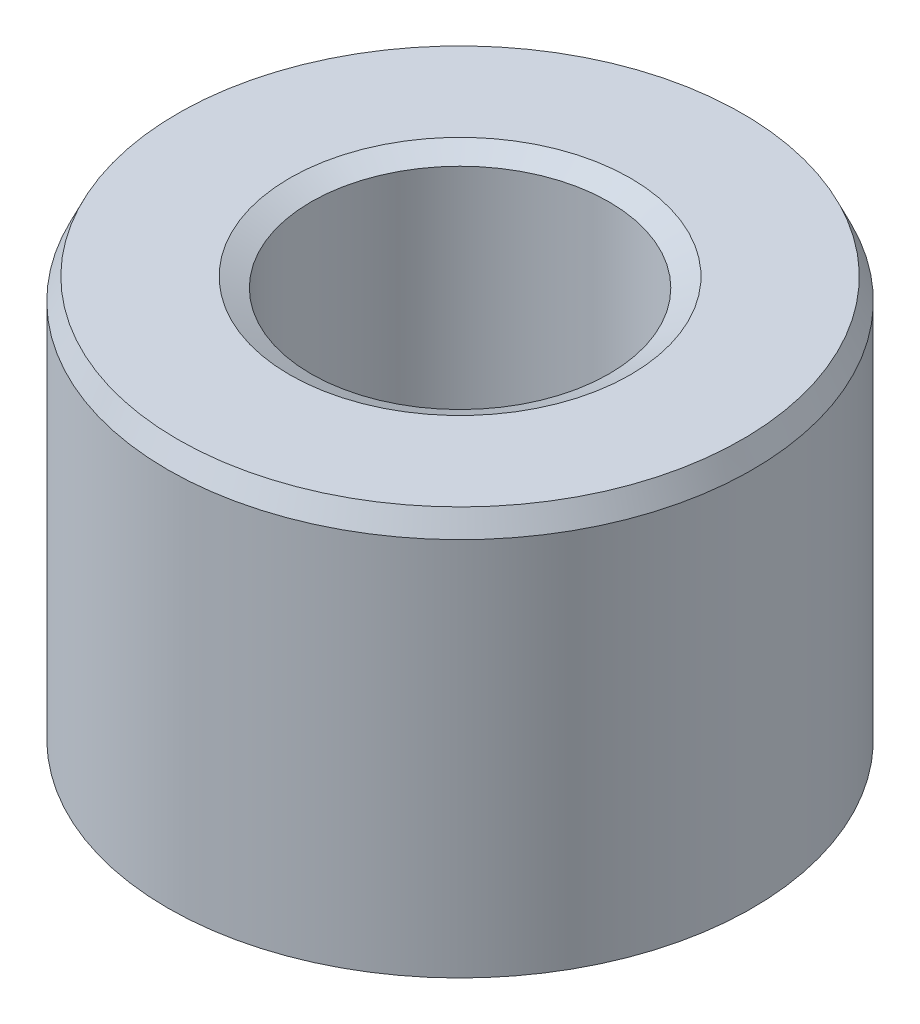
ISO-10303-21;
HEADER;
FILE_DESCRIPTION(('STEP AP214'),'2;1');
FILE_NAME('part.step','',(''),(''),'','','');
FILE_SCHEMA(('AUTOMOTIVE_DESIGN { 1 0 10303 214 1 1 1 1 }'));
ENDSEC;
DATA;
#1=APPLICATION_CONTEXT('core data for automotive mechanical design processes');
#2=APPLICATION_PROTOCOL_DEFINITION('international standard','automotive_design',2000,#1);
#3=PRODUCT_CONTEXT('',#1,'mechanical');
#4=PRODUCT('Part','Part','',(#3));
#5=PRODUCT_RELATED_PRODUCT_CATEGORY('part','',(#4));
#6=PRODUCT_DEFINITION_FORMATION('','',#4);
#7=PRODUCT_DEFINITION_CONTEXT('part definition',#1,'design');
#8=PRODUCT_DEFINITION('design','',#6,#7);
#9=PRODUCT_DEFINITION_SHAPE('','',#8);
#10=(LENGTH_UNIT() NAMED_UNIT(*) SI_UNIT(.MILLI.,.METRE.));
#11=(NAMED_UNIT(*) PLANE_ANGLE_UNIT() SI_UNIT($,.RADIAN.));
#12=(NAMED_UNIT(*) SI_UNIT($,.STERADIAN.) SOLID_ANGLE_UNIT());
#13=UNCERTAINTY_MEASURE_WITH_UNIT(LENGTH_MEASURE(1.E-05),#10,'distance_accuracy_value','');
#14=(GEOMETRIC_REPRESENTATION_CONTEXT(3) GLOBAL_UNCERTAINTY_ASSIGNED_CONTEXT((#13)) GLOBAL_UNIT_ASSIGNED_CONTEXT((#10,
#11,#12)) REPRESENTATION_CONTEXT('',''));
#15=CARTESIAN_POINT('',(0.,0.,0.));
#16=DIRECTION('',(0.,0.,1.));
#17=DIRECTION('',(1.,0.,0.));
#18=AXIS2_PLACEMENT_3D('',#15,#16,#17);
#19=CARTESIAN_POINT('',(0.,63.2652173476148,0.));
#20=DIRECTION('',(0.,-1.,0.));
#21=DIRECTION('',(0.,0.,-1.));
#22=AXIS2_PLACEMENT_3D('',#19,#20,#21);
#23=CYLINDRICAL_SURFACE('',#22,45.);
#24=CARTESIAN_POINT('',(0.,1.52763079185088,0.));
#25=DIRECTION('',(0.,1.,0.));
#26=DIRECTION('',(0.,0.,1.));
#27=AXIS2_PLACEMENT_3D('',#24,#25,#26);
#28=CIRCLE('',#27,45.);
#29=CARTESIAN_POINT('',(0.,1.52763079185088,45.));
#30=VERTEX_POINT('',#29);
#31=EDGE_CURVE('E10',#30,#30,#28,.T.);
#32=ORIENTED_EDGE('',*,*,#31,.T.);
#33=EDGE_LOOP('',(#32));
#34=FACE_BOUND('',#33,.T.);
#35=CARTESIAN_POINT('',(0.,59.978398435244,0.));
#36=DIRECTION('',(0.,1.,0.));
#37=DIRECTION('',(0.,0.,1.));
#38=AXIS2_PLACEMENT_3D('',#35,#36,#37);
#39=CIRCLE('',#38,45.);
#40=CARTESIAN_POINT('',(0.,59.978398435244,45.));
#41=VERTEX_POINT('',#40);
#42=EDGE_CURVE('E50',#41,#41,#39,.F.);
#43=ORIENTED_EDGE('',*,*,#42,.T.);
#44=EDGE_LOOP('',(#43));
#45=FACE_BOUND('',#44,.T.);
#46=ADVANCED_FACE('F39',(#34,#45),#23,.T.);
#47=CARTESIAN_POINT('',(0.,63.2652173476148,0.));
#48=DIRECTION('',(0.,1.,0.));
#49=DIRECTION('',(0.,0.,1.));
#50=AXIS2_PLACEMENT_3D('',#47,#48,#49);
#51=PLANE('',#50);
#52=CARTESIAN_POINT('',(0.,63.2652173476148,0.));
#53=DIRECTION('',(0.,1.,0.));
#54=DIRECTION('',(0.,0.,1.));
#55=AXIS2_PLACEMENT_3D('',#52,#53,#54);
#56=CIRCLE('',#55,26.2344121050548);
#57=CARTESIAN_POINT('',(0.,63.2652173476148,26.2344121050548));
#58=VERTEX_POINT('',#57);
#59=EDGE_CURVE('E58',#58,#58,#56,.F.);
#60=ORIENTED_EDGE('',*,*,#59,.T.);
#61=EDGE_LOOP('',(#60));
#62=FACE_BOUND('',#61,.T.);
#63=CARTESIAN_POINT('',(0.,63.2652173476148,0.));
#64=DIRECTION('',(0.,1.,0.));
#65=DIRECTION('',(0.,0.,1.));
#66=AXIS2_PLACEMENT_3D('',#63,#64,#65);
#67=CIRCLE('',#66,43.4723692081491);
#68=CARTESIAN_POINT('',(0.,63.2652173476148,43.4723692081491));
#69=VERTEX_POINT('',#68);
#70=EDGE_CURVE('E61',#69,#69,#67,.T.);
#71=ORIENTED_EDGE('',*,*,#70,.T.);
#72=EDGE_LOOP('',(#71));
#73=FACE_BOUND('',#72,.T.);
#74=ADVANCED_FACE('F88',(#62,#73),#51,.T.);
#75=CARTESIAN_POINT('',(0.,0.,0.));
#76=DIRECTION('',(0.,1.,0.));
#77=DIRECTION('',(0.,0.,1.));
#78=AXIS2_PLACEMENT_3D('',#75,#76,#77);
#79=PLANE('',#78);
#80=CARTESIAN_POINT('',(0.,0.,0.));
#81=DIRECTION('',(0.,1.,0.));
#82=DIRECTION('',(0.,0.,1.));
#83=AXIS2_PLACEMENT_3D('',#80,#81,#82);
#84=CIRCLE('',#83,24.4752239845348);
#85=CARTESIAN_POINT('',(0.,0.,24.4752239845348));
#86=VERTEX_POINT('',#85);
#87=EDGE_CURVE('E51',#86,#86,#84,.T.);
#88=ORIENTED_EDGE('',*,*,#87,.T.);
#89=EDGE_LOOP('',(#88));
#90=FACE_BOUND('',#89,.T.);
#91=CARTESIAN_POINT('',(0.,0.,0.));
#92=DIRECTION('',(0.,1.,0.));
#93=DIRECTION('',(0.,0.,1.));
#94=AXIS2_PLACEMENT_3D('',#91,#92,#93);
#95=CIRCLE('',#94,41.7131810876292);
#96=CARTESIAN_POINT('',(0.,0.,41.7131810876292));
#97=VERTEX_POINT('',#96);
#98=EDGE_CURVE('E54',#97,#97,#95,.F.);
#99=ORIENTED_EDGE('',*,*,#98,.T.);
#100=EDGE_LOOP('',(#99));
#101=FACE_BOUND('',#100,.T.);
#102=ADVANCED_FACE('F83',(#90,#101),#79,.F.);
#103=CARTESIAN_POINT('',(0.,63.2652173476148,0.));
#104=DIRECTION('',(0.,-1.,0.));
#105=DIRECTION('',(0.,0.,-1.));
#106=AXIS2_PLACEMENT_3D('',#103,#104,#105);
#107=CYLINDRICAL_SURFACE('',#106,22.947593192684);
#108=CARTESIAN_POINT('',(0.,61.7375865557639,0.));
#109=DIRECTION('',(0.,1.,0.));
#110=DIRECTION('',(0.,0.,1.));
#111=AXIS2_PLACEMENT_3D('',#108,#109,#110);
#112=CIRCLE('',#111,22.947593192684);
#113=CARTESIAN_POINT('',(0.,61.7375865557639,22.947593192684));
#114=VERTEX_POINT('',#113);
#115=EDGE_CURVE('E67',#114,#114,#112,.T.);
#116=ORIENTED_EDGE('',*,*,#115,.T.);
#117=EDGE_LOOP('',(#116));
#118=FACE_BOUND('',#117,.T.);
#119=CARTESIAN_POINT('',(0.,3.28681891237082,0.));
#120=DIRECTION('',(0.,1.,0.));
#121=DIRECTION('',(0.,0.,1.));
#122=AXIS2_PLACEMENT_3D('',#119,#120,#121);
#123=CIRCLE('',#122,22.947593192684);
#124=CARTESIAN_POINT('',(0.,3.28681891237082,22.947593192684));
#125=VERTEX_POINT('',#124);
#126=EDGE_CURVE('E69',#125,#125,#123,.F.);
#127=ORIENTED_EDGE('',*,*,#126,.T.);
#128=EDGE_LOOP('',(#127));
#129=FACE_BOUND('',#128,.T.);
#130=ADVANCED_FACE('F71',(#118,#129),#107,.F.);
#131=CARTESIAN_POINT('',(0.,61.7375865557639,0.));
#132=DIRECTION('',(0.,1.,0.));
#133=DIRECTION('',(0.,0.,1.));
#134=AXIS2_PLACEMENT_3D('',#131,#132,#133);
#135=CONICAL_SURFACE('',#134,22.947593192684,1.13572378564389);
#136=ORIENTED_EDGE('',*,*,#59,.F.);
#137=EDGE_LOOP('',(#136));
#138=FACE_BOUND('',#137,.T.);
#139=ORIENTED_EDGE('',*,*,#115,.F.);
#140=EDGE_LOOP('',(#139));
#141=FACE_BOUND('',#140,.T.);
#142=ADVANCED_FACE('F77',(#138,#141),#135,.F.);
#143=CARTESIAN_POINT('',(0.,0.,0.));
#144=DIRECTION('',(0.,-1.,0.));
#145=DIRECTION('',(0.,0.,-1.));
#146=AXIS2_PLACEMENT_3D('',#143,#144,#145);
#147=CONICAL_SURFACE('',#146,24.4752239845348,0.435072541151007);
#148=ORIENTED_EDGE('',*,*,#126,.F.);
#149=EDGE_LOOP('',(#148));
#150=FACE_BOUND('',#149,.T.);
#151=ORIENTED_EDGE('',*,*,#87,.F.);
#152=EDGE_LOOP('',(#151));
#153=FACE_BOUND('',#152,.T.);
#154=ADVANCED_FACE('F73',(#150,#153),#147,.F.);
#155=CARTESIAN_POINT('',(0.,1.52763079185088,0.));
#156=DIRECTION('',(0.,1.,0.));
#157=DIRECTION('',(0.,0.,1.));
#158=AXIS2_PLACEMENT_3D('',#155,#156,#157);
#159=CONICAL_SURFACE('',#158,45.,1.13572378564389);
#160=ORIENTED_EDGE('',*,*,#98,.F.);
#161=EDGE_LOOP('',(#160));
#162=FACE_BOUND('',#161,.T.);
#163=ORIENTED_EDGE('',*,*,#31,.F.);
#164=EDGE_LOOP('',(#163));
#165=FACE_BOUND('',#164,.T.);
#166=ADVANCED_FACE('F76',(#162,#165),#159,.T.);
#167=CARTESIAN_POINT('',(0.,63.2652173476148,0.));
#168=DIRECTION('',(0.,-1.,0.));
#169=DIRECTION('',(0.,0.,-1.));
#170=AXIS2_PLACEMENT_3D('',#167,#168,#169);
#171=CONICAL_SURFACE('',#170,43.4723692081491,0.435072541151005);
#172=ORIENTED_EDGE('',*,*,#42,.F.);
#173=EDGE_LOOP('',(#172));
#174=FACE_BOUND('',#173,.T.);
#175=ORIENTED_EDGE('',*,*,#70,.F.);
#176=EDGE_LOOP('',(#175));
#177=FACE_BOUND('',#176,.T.);
#178=ADVANCED_FACE('F45',(#174,#177),#171,.T.);
#179=CLOSED_SHELL('',(#46,#74,#102,#130,#142,#154,#166,#178));
#180=MANIFOLD_SOLID_BREP('B2',#179);
#181=ADVANCED_BREP_SHAPE_REPRESENTATION('',(#18,#180),#14);
#182=SHAPE_DEFINITION_REPRESENTATION(#9,#181);
ENDSEC;
END-ISO-10303-21;
